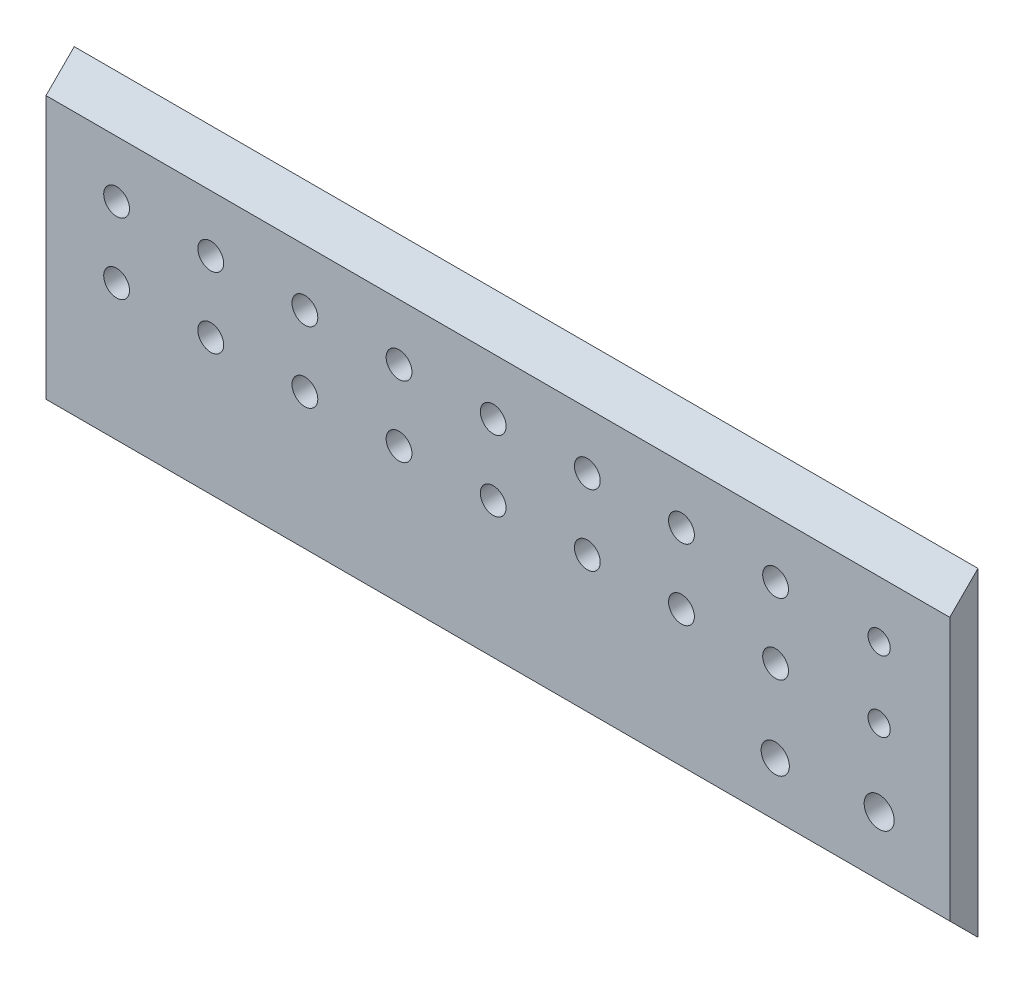
ISO-10303-21;
HEADER;
FILE_DESCRIPTION(('STEP AP214'),'2;1');
FILE_NAME('part.step','',(''),(''),'','','');
FILE_SCHEMA(('AUTOMOTIVE_DESIGN { 1 0 10303 214 1 1 1 1 }'));
ENDSEC;
DATA;
#1=APPLICATION_CONTEXT('core data for automotive mechanical design processes');
#2=APPLICATION_PROTOCOL_DEFINITION('international standard','automotive_design',2000,#1);
#3=PRODUCT_CONTEXT('',#1,'mechanical');
#4=PRODUCT('Part','Part','',(#3));
#5=PRODUCT_RELATED_PRODUCT_CATEGORY('part','',(#4));
#6=PRODUCT_DEFINITION_FORMATION('','',#4);
#7=PRODUCT_DEFINITION_CONTEXT('part definition',#1,'design');
#8=PRODUCT_DEFINITION('design','',#6,#7);
#9=PRODUCT_DEFINITION_SHAPE('','',#8);
#10=(LENGTH_UNIT() NAMED_UNIT(*) SI_UNIT(.MILLI.,.METRE.));
#11=(NAMED_UNIT(*) PLANE_ANGLE_UNIT() SI_UNIT($,.RADIAN.));
#12=(NAMED_UNIT(*) SI_UNIT($,.STERADIAN.) SOLID_ANGLE_UNIT());
#13=UNCERTAINTY_MEASURE_WITH_UNIT(LENGTH_MEASURE(1.E-05),#10,'distance_accuracy_value','');
#14=(GEOMETRIC_REPRESENTATION_CONTEXT(3) GLOBAL_UNCERTAINTY_ASSIGNED_CONTEXT((#13)) GLOBAL_UNIT_ASSIGNED_CONTEXT((#10,
#11,#12)) REPRESENTATION_CONTEXT('',''));
#15=CARTESIAN_POINT('',(0.,0.,0.));
#16=DIRECTION('',(0.,0.,1.));
#17=DIRECTION('',(1.,0.,0.));
#18=AXIS2_PLACEMENT_3D('',#15,#16,#17);
#19=CARTESIAN_POINT('',(164.041666666667,52.7920489685532,0.));
#20=DIRECTION('',(0.,0.,1.));
#21=DIRECTION('',(1.,0.,0.));
#22=AXIS2_PLACEMENT_3D('',#19,#20,#21);
#23=CYLINDRICAL_SURFACE('',#22,2.9);
#24=CARTESIAN_POINT('',(164.041666666667,52.7920489685532,0.));
#25=DIRECTION('',(0.,0.,1.));
#26=DIRECTION('',(1.,0.,0.));
#27=AXIS2_PLACEMENT_3D('',#24,#25,#26);
#28=CIRCLE('',#27,2.9);
#29=CARTESIAN_POINT('',(166.941666666667,52.7920489685532,0.));
#30=VERTEX_POINT('',#29);
#31=EDGE_CURVE('E41',#30,#30,#28,.T.);
#32=ORIENTED_EDGE('',*,*,#31,.F.);
#33=EDGE_LOOP('',(#32));
#34=FACE_BOUND('',#33,.T.);
#35=CARTESIAN_POINT('',(164.041666666667,52.7920489685532,6.35));
#36=DIRECTION('',(0.,0.,1.));
#37=DIRECTION('',(1.,0.,0.));
#38=AXIS2_PLACEMENT_3D('',#35,#36,#37);
#39=CIRCLE('',#38,2.9);
#40=CARTESIAN_POINT('',(166.941666666667,52.7920489685532,6.35));
#41=VERTEX_POINT('',#40);
#42=EDGE_CURVE('E11',#41,#41,#39,.T.);
#43=ORIENTED_EDGE('',*,*,#42,.T.);
#44=EDGE_LOOP('',(#43));
#45=FACE_BOUND('',#44,.T.);
#46=ADVANCED_FACE('F34',(#34,#45),#23,.F.);
#47=CARTESIAN_POINT('',(142.875,52.7920489685532,0.));
#48=DIRECTION('',(0.,0.,1.));
#49=DIRECTION('',(1.,0.,0.));
#50=AXIS2_PLACEMENT_3D('',#47,#48,#49);
#51=CYLINDRICAL_SURFACE('',#50,2.9);
#52=CARTESIAN_POINT('',(142.875,52.7920489685532,0.));
#53=DIRECTION('',(0.,0.,1.));
#54=DIRECTION('',(1.,0.,0.));
#55=AXIS2_PLACEMENT_3D('',#52,#53,#54);
#56=CIRCLE('',#55,2.9);
#57=CARTESIAN_POINT('',(145.775,52.7920489685532,0.));
#58=VERTEX_POINT('',#57);
#59=EDGE_CURVE('E131',#58,#58,#56,.T.);
#60=ORIENTED_EDGE('',*,*,#59,.F.);
#61=EDGE_LOOP('',(#60));
#62=FACE_BOUND('',#61,.T.);
#63=CARTESIAN_POINT('',(142.875,52.7920489685532,6.35));
#64=DIRECTION('',(0.,0.,1.));
#65=DIRECTION('',(1.,0.,0.));
#66=AXIS2_PLACEMENT_3D('',#63,#64,#65);
#67=CIRCLE('',#66,2.9);
#68=CARTESIAN_POINT('',(145.775,52.7920489685532,6.35));
#69=VERTEX_POINT('',#68);
#70=EDGE_CURVE('E134',#69,#69,#67,.T.);
#71=ORIENTED_EDGE('',*,*,#70,.T.);
#72=EDGE_LOOP('',(#71));
#73=FACE_BOUND('',#72,.T.);
#74=ADVANCED_FACE('F143',(#62,#73),#51,.F.);
#75=CARTESIAN_POINT('',(121.708333333333,52.7920489685532,0.));
#76=DIRECTION('',(0.,0.,1.));
#77=DIRECTION('',(1.,0.,0.));
#78=AXIS2_PLACEMENT_3D('',#75,#76,#77);
#79=CYLINDRICAL_SURFACE('',#78,2.9);
#80=CARTESIAN_POINT('',(121.708333333333,52.7920489685532,0.));
#81=DIRECTION('',(0.,0.,1.));
#82=DIRECTION('',(1.,0.,0.));
#83=AXIS2_PLACEMENT_3D('',#80,#81,#82);
#84=CIRCLE('',#83,2.9);
#85=CARTESIAN_POINT('',(124.608333333333,52.7920489685532,0.));
#86=VERTEX_POINT('',#85);
#87=EDGE_CURVE('E125',#86,#86,#84,.T.);
#88=ORIENTED_EDGE('',*,*,#87,.F.);
#89=EDGE_LOOP('',(#88));
#90=FACE_BOUND('',#89,.T.);
#91=CARTESIAN_POINT('',(121.708333333333,52.7920489685532,6.35));
#92=DIRECTION('',(0.,0.,1.));
#93=DIRECTION('',(1.,0.,0.));
#94=AXIS2_PLACEMENT_3D('',#91,#92,#93);
#95=CIRCLE('',#94,2.9);
#96=CARTESIAN_POINT('',(124.608333333333,52.7920489685532,6.35));
#97=VERTEX_POINT('',#96);
#98=EDGE_CURVE('E128',#97,#97,#95,.T.);
#99=ORIENTED_EDGE('',*,*,#98,.T.);
#100=EDGE_LOOP('',(#99));
#101=FACE_BOUND('',#100,.T.);
#102=ADVANCED_FACE('F178',(#90,#101),#79,.F.);
#103=CARTESIAN_POINT('',(100.541666666667,52.7920489685532,0.));
#104=DIRECTION('',(0.,0.,1.));
#105=DIRECTION('',(1.,0.,0.));
#106=AXIS2_PLACEMENT_3D('',#103,#104,#105);
#107=CYLINDRICAL_SURFACE('',#106,2.9);
#108=CARTESIAN_POINT('',(100.541666666667,52.7920489685532,0.));
#109=DIRECTION('',(0.,0.,1.));
#110=DIRECTION('',(1.,0.,0.));
#111=AXIS2_PLACEMENT_3D('',#108,#109,#110);
#112=CIRCLE('',#111,2.9);
#113=CARTESIAN_POINT('',(103.441666666667,52.7920489685532,0.));
#114=VERTEX_POINT('',#113);
#115=EDGE_CURVE('E119',#114,#114,#112,.T.);
#116=ORIENTED_EDGE('',*,*,#115,.F.);
#117=EDGE_LOOP('',(#116));
#118=FACE_BOUND('',#117,.T.);
#119=CARTESIAN_POINT('',(100.541666666667,52.7920489685532,6.35));
#120=DIRECTION('',(0.,0.,1.));
#121=DIRECTION('',(1.,0.,0.));
#122=AXIS2_PLACEMENT_3D('',#119,#120,#121);
#123=CIRCLE('',#122,2.9);
#124=CARTESIAN_POINT('',(103.441666666667,52.7920489685532,6.35));
#125=VERTEX_POINT('',#124);
#126=EDGE_CURVE('E122',#125,#125,#123,.T.);
#127=ORIENTED_EDGE('',*,*,#126,.T.);
#128=EDGE_LOOP('',(#127));
#129=FACE_BOUND('',#128,.T.);
#130=ADVANCED_FACE('F174',(#118,#129),#107,.F.);
#131=CARTESIAN_POINT('',(79.375,52.7920489685532,0.));
#132=DIRECTION('',(0.,0.,1.));
#133=DIRECTION('',(1.,0.,0.));
#134=AXIS2_PLACEMENT_3D('',#131,#132,#133);
#135=CYLINDRICAL_SURFACE('',#134,2.9);
#136=CARTESIAN_POINT('',(79.375,52.7920489685532,0.));
#137=DIRECTION('',(0.,0.,1.));
#138=DIRECTION('',(1.,0.,0.));
#139=AXIS2_PLACEMENT_3D('',#136,#137,#138);
#140=CIRCLE('',#139,2.9);
#141=CARTESIAN_POINT('',(82.275,52.7920489685532,0.));
#142=VERTEX_POINT('',#141);
#143=EDGE_CURVE('E113',#142,#142,#140,.T.);
#144=ORIENTED_EDGE('',*,*,#143,.F.);
#145=EDGE_LOOP('',(#144));
#146=FACE_BOUND('',#145,.T.);
#147=CARTESIAN_POINT('',(79.375,52.7920489685532,6.35));
#148=DIRECTION('',(0.,0.,1.));
#149=DIRECTION('',(1.,0.,0.));
#150=AXIS2_PLACEMENT_3D('',#147,#148,#149);
#151=CIRCLE('',#150,2.9);
#152=CARTESIAN_POINT('',(82.275,52.7920489685532,6.35));
#153=VERTEX_POINT('',#152);
#154=EDGE_CURVE('E116',#153,#153,#151,.T.);
#155=ORIENTED_EDGE('',*,*,#154,.T.);
#156=EDGE_LOOP('',(#155));
#157=FACE_BOUND('',#156,.T.);
#158=ADVANCED_FACE('F170',(#146,#157),#135,.F.);
#159=CARTESIAN_POINT('',(58.2083333333333,52.7920489685532,0.));
#160=DIRECTION('',(0.,0.,1.));
#161=DIRECTION('',(1.,0.,0.));
#162=AXIS2_PLACEMENT_3D('',#159,#160,#161);
#163=CYLINDRICAL_SURFACE('',#162,2.9);
#164=CARTESIAN_POINT('',(58.2083333333333,52.7920489685532,0.));
#165=DIRECTION('',(0.,0.,1.));
#166=DIRECTION('',(1.,0.,0.));
#167=AXIS2_PLACEMENT_3D('',#164,#165,#166);
#168=CIRCLE('',#167,2.9);
#169=CARTESIAN_POINT('',(61.1083333333333,52.7920489685532,0.));
#170=VERTEX_POINT('',#169);
#171=EDGE_CURVE('E94',#170,#170,#168,.T.);
#172=ORIENTED_EDGE('',*,*,#171,.F.);
#173=EDGE_LOOP('',(#172));
#174=FACE_BOUND('',#173,.T.);
#175=CARTESIAN_POINT('',(58.2083333333333,52.7920489685532,6.35));
#176=DIRECTION('',(0.,0.,1.));
#177=DIRECTION('',(1.,0.,0.));
#178=AXIS2_PLACEMENT_3D('',#175,#176,#177);
#179=CIRCLE('',#178,2.9);
#180=CARTESIAN_POINT('',(61.1083333333333,52.7920489685532,6.35));
#181=VERTEX_POINT('',#180);
#182=EDGE_CURVE('E98',#181,#181,#179,.T.);
#183=ORIENTED_EDGE('',*,*,#182,.T.);
#184=EDGE_LOOP('',(#183));
#185=FACE_BOUND('',#184,.T.);
#186=ADVANCED_FACE('F166',(#174,#185),#163,.F.);
#187=CARTESIAN_POINT('',(0.,0.,6.35));
#188=DIRECTION('',(1.,0.,0.));
#189=DIRECTION('',(0.,0.,-1.));
#190=AXIS2_PLACEMENT_3D('',#187,#188,#189);
#191=PLANE('',#190);
#192=DIRECTION('',(0.,-1.,0.));
#193=VECTOR('',#192,1.);
#194=CARTESIAN_POINT('',(0.,0.,6.35));
#195=LINE('',#194,#193);
#196=CARTESIAN_POINT('',(0.,65.4920489685532,6.35));
#197=VERTEX_POINT('',#196);
#198=CARTESIAN_POINT('',(0.,6.35,6.35));
#199=VERTEX_POINT('',#198);
#200=EDGE_CURVE('E95',#197,#199,#195,.T.);
#201=ORIENTED_EDGE('',*,*,#200,.F.);
#202=DIRECTION('',(0.,-0.707106781186547,0.707106781186548));
#203=VECTOR('',#202,1.);
#204=CARTESIAN_POINT('',(0.,65.4920489685532,6.35));
#205=LINE('',#204,#203);
#206=CARTESIAN_POINT('',(0.,71.8420489685532,0.));
#207=VERTEX_POINT('',#206);
#208=EDGE_CURVE('E76',#207,#197,#205,.T.);
#209=ORIENTED_EDGE('',*,*,#208,.F.);
#210=DIRECTION('',(0.,-1.,0.));
#211=VECTOR('',#210,1.);
#212=CARTESIAN_POINT('',(0.,0.,0.));
#213=LINE('',#212,#211);
#214=CARTESIAN_POINT('',(0.,0.,0.));
#215=VERTEX_POINT('',#214);
#216=EDGE_CURVE('E104',#207,#215,#213,.T.);
#217=ORIENTED_EDGE('',*,*,#216,.T.);
#218=DIRECTION('',(0.,-0.707106781186548,-0.707106781186547));
#219=VECTOR('',#218,1.);
#220=CARTESIAN_POINT('',(0.,6.35,6.35));
#221=LINE('',#220,#219);
#222=EDGE_CURVE('E56',#199,#215,#221,.T.);
#223=ORIENTED_EDGE('',*,*,#222,.F.);
#224=EDGE_LOOP('',(#201,#209,#217,#223));
#225=FACE_BOUND('',#224,.T.);
#226=ADVANCED_FACE('F157',(#225),#191,.F.);
#227=CARTESIAN_POINT('',(203.2,0.,6.35));
#228=DIRECTION('',(-1.,0.,0.));
#229=DIRECTION('',(0.,0.,1.));
#230=AXIS2_PLACEMENT_3D('',#227,#228,#229);
#231=PLANE('',#230);
#232=DIRECTION('',(0.,1.,0.));
#233=VECTOR('',#232,1.);
#234=CARTESIAN_POINT('',(203.2,0.,0.));
#235=LINE('',#234,#233);
#236=CARTESIAN_POINT('',(203.2,0.,0.));
#237=VERTEX_POINT('',#236);
#238=CARTESIAN_POINT('',(203.2,71.8420489685532,0.));
#239=VERTEX_POINT('',#238);
#240=EDGE_CURVE('E87',#237,#239,#235,.T.);
#241=ORIENTED_EDGE('',*,*,#240,.T.);
#242=DIRECTION('',(0.,-0.707106781186547,0.707106781186548));
#243=VECTOR('',#242,1.);
#244=CARTESIAN_POINT('',(203.2,65.4920489685532,6.35));
#245=LINE('',#244,#243);
#246=CARTESIAN_POINT('',(203.2,65.4920489685532,6.35));
#247=VERTEX_POINT('',#246);
#248=EDGE_CURVE('E48',#239,#247,#245,.T.);
#249=ORIENTED_EDGE('',*,*,#248,.T.);
#250=DIRECTION('',(0.,1.,0.));
#251=VECTOR('',#250,1.);
#252=CARTESIAN_POINT('',(203.2,0.,6.35));
#253=LINE('',#252,#251);
#254=CARTESIAN_POINT('',(203.2,6.35,6.35));
#255=VERTEX_POINT('',#254);
#256=EDGE_CURVE('E85',#255,#247,#253,.T.);
#257=ORIENTED_EDGE('',*,*,#256,.F.);
#258=DIRECTION('',(0.,-0.707106781186548,-0.707106781186547));
#259=VECTOR('',#258,1.);
#260=CARTESIAN_POINT('',(203.2,6.35,6.35));
#261=LINE('',#260,#259);
#262=EDGE_CURVE('E484',#255,#237,#261,.T.);
#263=ORIENTED_EDGE('',*,*,#262,.T.);
#264=EDGE_LOOP('',(#241,#249,#257,#263));
#265=FACE_BOUND('',#264,.T.);
#266=ADVANCED_FACE('F83',(#265),#231,.F.);
#267=CARTESIAN_POINT('',(0.,0.,6.35));
#268=DIRECTION('',(0.,0.,-1.));
#269=DIRECTION('',(-1.,0.,0.));
#270=AXIS2_PLACEMENT_3D('',#267,#268,#269);
#271=PLANE('',#270);
#272=CARTESIAN_POINT('',(163.957,18.4642256934485,6.35));
#273=DIRECTION('',(0.,0.,1.));
#274=DIRECTION('',(1.,0.,0.));
#275=AXIS2_PLACEMENT_3D('',#272,#273,#274);
#276=CIRCLE('',#275,3.175);
#277=CARTESIAN_POINT('',(167.132,18.4642256934485,6.35));
#278=VERTEX_POINT('',#277);
#279=EDGE_CURVE('E401',#278,#278,#276,.T.);
#280=ORIENTED_EDGE('',*,*,#279,.F.);
#281=EDGE_LOOP('',(#280));
#282=FACE_BOUND('',#281,.T.);
#283=CARTESIAN_POINT('',(187.325,19.6511137980185,6.35));
#284=DIRECTION('',(0.,0.,1.));
#285=DIRECTION('',(1.,0.,0.));
#286=AXIS2_PLACEMENT_3D('',#283,#284,#285);
#287=CIRCLE('',#286,3.37499999999999);
#288=CARTESIAN_POINT('',(190.7,19.6511137980185,6.35));
#289=VERTEX_POINT('',#288);
#290=EDGE_CURVE('E403',#289,#289,#287,.T.);
#291=ORIENTED_EDGE('',*,*,#290,.F.);
#292=EDGE_LOOP('',(#291));
#293=FACE_BOUND('',#292,.T.);
#294=CARTESIAN_POINT('',(187.325,36.9170489685532,6.35));
#295=DIRECTION('',(0.,0.,1.));
#296=DIRECTION('',(1.,0.,0.));
#297=AXIS2_PLACEMENT_3D('',#294,#295,#296);
#298=CIRCLE('',#297,2.5);
#299=CARTESIAN_POINT('',(189.825,36.9170489685532,6.35));
#300=VERTEX_POINT('',#299);
#301=EDGE_CURVE('E409',#300,#300,#298,.T.);
#302=ORIENTED_EDGE('',*,*,#301,.F.);
#303=EDGE_LOOP('',(#302));
#304=FACE_BOUND('',#303,.T.);
#305=CARTESIAN_POINT('',(187.325,52.7920489685532,6.35));
#306=DIRECTION('',(0.,0.,1.));
#307=DIRECTION('',(1.,0.,0.));
#308=AXIS2_PLACEMENT_3D('',#305,#306,#307);
#309=CIRCLE('',#308,2.5);
#310=CARTESIAN_POINT('',(189.825,52.7920489685532,6.35));
#311=VERTEX_POINT('',#310);
#312=EDGE_CURVE('E415',#311,#311,#309,.T.);
#313=ORIENTED_EDGE('',*,*,#312,.F.);
#314=EDGE_LOOP('',(#313));
#315=FACE_BOUND('',#314,.T.);
#316=CARTESIAN_POINT('',(37.0416666666667,36.9170489685532,6.35));
#317=DIRECTION('',(0.,0.,1.));
#318=DIRECTION('',(1.,0.,0.));
#319=AXIS2_PLACEMENT_3D('',#316,#317,#318);
#320=CIRCLE('',#319,2.9);
#321=CARTESIAN_POINT('',(39.9416666666667,36.9170489685532,6.35));
#322=VERTEX_POINT('',#321);
#323=EDGE_CURVE('E428',#322,#322,#320,.T.);
#324=ORIENTED_EDGE('',*,*,#323,.F.);
#325=EDGE_LOOP('',(#324));
#326=FACE_BOUND('',#325,.T.);
#327=CARTESIAN_POINT('',(58.2083333333333,36.9170489685532,6.35));
#328=DIRECTION('',(0.,0.,1.));
#329=DIRECTION('',(1.,0.,0.));
#330=AXIS2_PLACEMENT_3D('',#327,#328,#329);
#331=CIRCLE('',#330,2.9);
#332=CARTESIAN_POINT('',(61.1083333333333,36.9170489685532,6.35));
#333=VERTEX_POINT('',#332);
#334=EDGE_CURVE('E434',#333,#333,#331,.T.);
#335=ORIENTED_EDGE('',*,*,#334,.F.);
#336=EDGE_LOOP('',(#335));
#337=FACE_BOUND('',#336,.T.);
#338=CARTESIAN_POINT('',(79.375,36.9170489685532,6.35));
#339=DIRECTION('',(0.,0.,1.));
#340=DIRECTION('',(1.,0.,0.));
#341=AXIS2_PLACEMENT_3D('',#338,#339,#340);
#342=CIRCLE('',#341,2.9);
#343=CARTESIAN_POINT('',(82.275,36.9170489685532,6.35));
#344=VERTEX_POINT('',#343);
#345=EDGE_CURVE('E440',#344,#344,#342,.T.);
#346=ORIENTED_EDGE('',*,*,#345,.F.);
#347=EDGE_LOOP('',(#346));
#348=FACE_BOUND('',#347,.T.);
#349=CARTESIAN_POINT('',(100.541666666667,36.9170489685532,6.35));
#350=DIRECTION('',(0.,0.,1.));
#351=DIRECTION('',(1.,0.,0.));
#352=AXIS2_PLACEMENT_3D('',#349,#350,#351);
#353=CIRCLE('',#352,2.9);
#354=CARTESIAN_POINT('',(103.441666666667,36.9170489685532,6.35));
#355=VERTEX_POINT('',#354);
#356=EDGE_CURVE('E446',#355,#355,#353,.T.);
#357=ORIENTED_EDGE('',*,*,#356,.F.);
#358=EDGE_LOOP('',(#357));
#359=FACE_BOUND('',#358,.T.);
#360=CARTESIAN_POINT('',(121.708333333333,36.9170489685532,6.35));
#361=DIRECTION('',(0.,0.,1.));
#362=DIRECTION('',(1.,0.,0.));
#363=AXIS2_PLACEMENT_3D('',#360,#361,#362);
#364=CIRCLE('',#363,2.9);
#365=CARTESIAN_POINT('',(124.608333333333,36.9170489685532,6.35));
#366=VERTEX_POINT('',#365);
#367=EDGE_CURVE('E452',#366,#366,#364,.T.);
#368=ORIENTED_EDGE('',*,*,#367,.F.);
#369=EDGE_LOOP('',(#368));
#370=FACE_BOUND('',#369,.T.);
#371=CARTESIAN_POINT('',(142.875,36.9170489685532,6.35));
#372=DIRECTION('',(0.,0.,1.));
#373=DIRECTION('',(1.,0.,0.));
#374=AXIS2_PLACEMENT_3D('',#371,#372,#373);
#375=CIRCLE('',#374,2.9);
#376=CARTESIAN_POINT('',(145.775,36.9170489685532,6.35));
#377=VERTEX_POINT('',#376);
#378=EDGE_CURVE('E458',#377,#377,#375,.T.);
#379=ORIENTED_EDGE('',*,*,#378,.F.);
#380=EDGE_LOOP('',(#379));
#381=FACE_BOUND('',#380,.T.);
#382=CARTESIAN_POINT('',(164.041666666667,36.9170489685532,6.35));
#383=DIRECTION('',(0.,0.,1.));
#384=DIRECTION('',(1.,0.,0.));
#385=AXIS2_PLACEMENT_3D('',#382,#383,#384);
#386=CIRCLE('',#385,2.9);
#387=CARTESIAN_POINT('',(166.941666666667,36.9170489685532,6.35));
#388=VERTEX_POINT('',#387);
#389=EDGE_CURVE('E421',#388,#388,#386,.T.);
#390=ORIENTED_EDGE('',*,*,#389,.F.);
#391=EDGE_LOOP('',(#390));
#392=FACE_BOUND('',#391,.T.);
#393=CARTESIAN_POINT('',(15.875,36.9170489685532,6.35));
#394=DIRECTION('',(0.,0.,1.));
#395=DIRECTION('',(1.,0.,0.));
#396=AXIS2_PLACEMENT_3D('',#393,#394,#395);
#397=CIRCLE('',#396,2.9);
#398=CARTESIAN_POINT('',(18.775,36.9170489685532,6.35));
#399=VERTEX_POINT('',#398);
#400=EDGE_CURVE('E427',#399,#399,#397,.T.);
#401=ORIENTED_EDGE('',*,*,#400,.F.);
#402=EDGE_LOOP('',(#401));
#403=FACE_BOUND('',#402,.T.);
#404=CARTESIAN_POINT('',(37.0416666666667,52.7920489685532,6.35));
#405=DIRECTION('',(0.,0.,1.));
#406=DIRECTION('',(1.,0.,0.));
#407=AXIS2_PLACEMENT_3D('',#404,#405,#406);
#408=CIRCLE('',#407,2.9);
#409=CARTESIAN_POINT('',(39.9416666666667,52.7920489685532,6.35));
#410=VERTEX_POINT('',#409);
#411=EDGE_CURVE('E474',#410,#410,#408,.T.);
#412=ORIENTED_EDGE('',*,*,#411,.F.);
#413=EDGE_LOOP('',(#412));
#414=FACE_BOUND('',#413,.T.);
#415=CARTESIAN_POINT('',(15.875,52.7920489685532,6.35));
#416=DIRECTION('',(0.,0.,1.));
#417=DIRECTION('',(1.,0.,0.));
#418=AXIS2_PLACEMENT_3D('',#415,#416,#417);
#419=CIRCLE('',#418,2.9);
#420=CARTESIAN_POINT('',(18.775,52.7920489685532,6.35));
#421=VERTEX_POINT('',#420);
#422=EDGE_CURVE('E477',#421,#421,#419,.T.);
#423=ORIENTED_EDGE('',*,*,#422,.F.);
#424=EDGE_LOOP('',(#423));
#425=FACE_BOUND('',#424,.T.);
#426=ORIENTED_EDGE('',*,*,#256,.T.);
#427=DIRECTION('',(-1.,0.,0.));
#428=VECTOR('',#427,1.);
#429=CARTESIAN_POINT('',(203.2,65.4920489685532,6.35));
#430=LINE('',#429,#428);
#431=EDGE_CURVE('E73',#247,#197,#430,.T.);
#432=ORIENTED_EDGE('',*,*,#431,.T.);
#433=ORIENTED_EDGE('',*,*,#200,.T.);
#434=DIRECTION('',(-1.,0.,0.));
#435=VECTOR('',#434,1.);
#436=CARTESIAN_POINT('',(203.2,6.35,6.35));
#437=LINE('',#436,#435);
#438=EDGE_CURVE('E93',#255,#199,#437,.T.);
#439=ORIENTED_EDGE('',*,*,#438,.F.);
#440=EDGE_LOOP('',(#426,#432,#433,#439));
#441=FACE_BOUND('',#440,.T.);
#442=ORIENTED_EDGE('',*,*,#182,.F.);
#443=EDGE_LOOP('',(#442));
#444=FACE_BOUND('',#443,.T.);
#445=ORIENTED_EDGE('',*,*,#154,.F.);
#446=EDGE_LOOP('',(#445));
#447=FACE_BOUND('',#446,.T.);
#448=ORIENTED_EDGE('',*,*,#126,.F.);
#449=EDGE_LOOP('',(#448));
#450=FACE_BOUND('',#449,.T.);
#451=ORIENTED_EDGE('',*,*,#98,.F.);
#452=EDGE_LOOP('',(#451));
#453=FACE_BOUND('',#452,.T.);
#454=ORIENTED_EDGE('',*,*,#70,.F.);
#455=EDGE_LOOP('',(#454));
#456=FACE_BOUND('',#455,.T.);
#457=ORIENTED_EDGE('',*,*,#42,.F.);
#458=EDGE_LOOP('',(#457));
#459=FACE_BOUND('',#458,.T.);
#460=ADVANCED_FACE('F91',(#282,#293,#304,#315,#326,#337,#348,#359,#370,#381,#392,#403,#414,#425,
#441,#444,#447,#450,#453,#456,#459),#271,.F.);
#461=CARTESIAN_POINT('',(0.,0.,0.));
#462=DIRECTION('',(0.,0.,-1.));
#463=DIRECTION('',(-1.,0.,0.));
#464=AXIS2_PLACEMENT_3D('',#461,#462,#463);
#465=PLANE('',#464);
#466=CARTESIAN_POINT('',(163.957,18.4642256934485,0.));
#467=DIRECTION('',(0.,0.,1.));
#468=DIRECTION('',(1.,0.,0.));
#469=AXIS2_PLACEMENT_3D('',#466,#467,#468);
#470=CIRCLE('',#469,3.175);
#471=CARTESIAN_POINT('',(167.132,18.4642256934485,0.));
#472=VERTEX_POINT('',#471);
#473=EDGE_CURVE('E399',#472,#472,#470,.T.);
#474=ORIENTED_EDGE('',*,*,#473,.T.);
#475=EDGE_LOOP('',(#474));
#476=FACE_BOUND('',#475,.T.);
#477=CARTESIAN_POINT('',(187.325,19.6511137980185,0.));
#478=DIRECTION('',(0.,0.,1.));
#479=DIRECTION('',(1.,0.,0.));
#480=AXIS2_PLACEMENT_3D('',#477,#478,#479);
#481=CIRCLE('',#480,3.37499999999999);
#482=CARTESIAN_POINT('',(190.7,19.6511137980185,0.));
#483=VERTEX_POINT('',#482);
#484=EDGE_CURVE('E406',#483,#483,#481,.T.);
#485=ORIENTED_EDGE('',*,*,#484,.T.);
#486=EDGE_LOOP('',(#485));
#487=FACE_BOUND('',#486,.T.);
#488=CARTESIAN_POINT('',(187.325,36.9170489685532,0.));
#489=DIRECTION('',(0.,0.,1.));
#490=DIRECTION('',(1.,0.,0.));
#491=AXIS2_PLACEMENT_3D('',#488,#489,#490);
#492=CIRCLE('',#491,2.5);
#493=CARTESIAN_POINT('',(189.825,36.9170489685532,0.));
#494=VERTEX_POINT('',#493);
#495=EDGE_CURVE('E412',#494,#494,#492,.T.);
#496=ORIENTED_EDGE('',*,*,#495,.T.);
#497=EDGE_LOOP('',(#496));
#498=FACE_BOUND('',#497,.T.);
#499=CARTESIAN_POINT('',(187.325,52.7920489685532,0.));
#500=DIRECTION('',(0.,0.,1.));
#501=DIRECTION('',(1.,0.,0.));
#502=AXIS2_PLACEMENT_3D('',#499,#500,#501);
#503=CIRCLE('',#502,2.5);
#504=CARTESIAN_POINT('',(189.825,52.7920489685532,0.));
#505=VERTEX_POINT('',#504);
#506=EDGE_CURVE('E418',#505,#505,#503,.T.);
#507=ORIENTED_EDGE('',*,*,#506,.T.);
#508=EDGE_LOOP('',(#507));
#509=FACE_BOUND('',#508,.T.);
#510=CARTESIAN_POINT('',(37.0416666666667,36.9170489685532,0.));
#511=DIRECTION('',(0.,0.,1.));
#512=DIRECTION('',(1.,0.,0.));
#513=AXIS2_PLACEMENT_3D('',#510,#511,#512);
#514=CIRCLE('',#513,2.9);
#515=CARTESIAN_POINT('',(39.9416666666667,36.9170489685532,0.));
#516=VERTEX_POINT('',#515);
#517=EDGE_CURVE('E424',#516,#516,#514,.T.);
#518=ORIENTED_EDGE('',*,*,#517,.T.);
#519=EDGE_LOOP('',(#518));
#520=FACE_BOUND('',#519,.T.);
#521=CARTESIAN_POINT('',(58.2083333333333,36.9170489685532,0.));
#522=DIRECTION('',(0.,0.,1.));
#523=DIRECTION('',(1.,0.,0.));
#524=AXIS2_PLACEMENT_3D('',#521,#522,#523);
#525=CIRCLE('',#524,2.9);
#526=CARTESIAN_POINT('',(61.1083333333333,36.9170489685532,0.));
#527=VERTEX_POINT('',#526);
#528=EDGE_CURVE('E431',#527,#527,#525,.T.);
#529=ORIENTED_EDGE('',*,*,#528,.T.);
#530=EDGE_LOOP('',(#529));
#531=FACE_BOUND('',#530,.T.);
#532=CARTESIAN_POINT('',(79.375,36.9170489685532,0.));
#533=DIRECTION('',(0.,0.,1.));
#534=DIRECTION('',(1.,0.,0.));
#535=AXIS2_PLACEMENT_3D('',#532,#533,#534);
#536=CIRCLE('',#535,2.9);
#537=CARTESIAN_POINT('',(82.275,36.9170489685532,0.));
#538=VERTEX_POINT('',#537);
#539=EDGE_CURVE('E437',#538,#538,#536,.T.);
#540=ORIENTED_EDGE('',*,*,#539,.T.);
#541=EDGE_LOOP('',(#540));
#542=FACE_BOUND('',#541,.T.);
#543=CARTESIAN_POINT('',(100.541666666667,36.9170489685532,0.));
#544=DIRECTION('',(0.,0.,1.));
#545=DIRECTION('',(1.,0.,0.));
#546=AXIS2_PLACEMENT_3D('',#543,#544,#545);
#547=CIRCLE('',#546,2.9);
#548=CARTESIAN_POINT('',(103.441666666667,36.9170489685532,0.));
#549=VERTEX_POINT('',#548);
#550=EDGE_CURVE('E443',#549,#549,#547,.T.);
#551=ORIENTED_EDGE('',*,*,#550,.T.);
#552=EDGE_LOOP('',(#551));
#553=FACE_BOUND('',#552,.T.);
#554=CARTESIAN_POINT('',(121.708333333333,36.9170489685532,0.));
#555=DIRECTION('',(0.,0.,1.));
#556=DIRECTION('',(1.,0.,0.));
#557=AXIS2_PLACEMENT_3D('',#554,#555,#556);
#558=CIRCLE('',#557,2.9);
#559=CARTESIAN_POINT('',(124.608333333333,36.9170489685532,0.));
#560=VERTEX_POINT('',#559);
#561=EDGE_CURVE('E449',#560,#560,#558,.T.);
#562=ORIENTED_EDGE('',*,*,#561,.T.);
#563=EDGE_LOOP('',(#562));
#564=FACE_BOUND('',#563,.T.);
#565=CARTESIAN_POINT('',(142.875,36.9170489685532,0.));
#566=DIRECTION('',(0.,0.,1.));
#567=DIRECTION('',(1.,0.,0.));
#568=AXIS2_PLACEMENT_3D('',#565,#566,#567);
#569=CIRCLE('',#568,2.9);
#570=CARTESIAN_POINT('',(145.775,36.9170489685532,0.));
#571=VERTEX_POINT('',#570);
#572=EDGE_CURVE('E455',#571,#571,#569,.T.);
#573=ORIENTED_EDGE('',*,*,#572,.T.);
#574=EDGE_LOOP('',(#573));
#575=FACE_BOUND('',#574,.T.);
#576=CARTESIAN_POINT('',(164.041666666667,36.9170489685532,0.));
#577=DIRECTION('',(0.,0.,1.));
#578=DIRECTION('',(1.,0.,0.));
#579=AXIS2_PLACEMENT_3D('',#576,#577,#578);
#580=CIRCLE('',#579,2.9);
#581=CARTESIAN_POINT('',(166.941666666667,36.9170489685532,0.));
#582=VERTEX_POINT('',#581);
#583=EDGE_CURVE('E461',#582,#582,#580,.T.);
#584=ORIENTED_EDGE('',*,*,#583,.T.);
#585=EDGE_LOOP('',(#584));
#586=FACE_BOUND('',#585,.T.);
#587=CARTESIAN_POINT('',(15.875,36.9170489685532,0.));
#588=DIRECTION('',(0.,0.,1.));
#589=DIRECTION('',(1.,0.,0.));
#590=AXIS2_PLACEMENT_3D('',#587,#588,#589);
#591=CIRCLE('',#590,2.9);
#592=CARTESIAN_POINT('',(18.775,36.9170489685532,0.));
#593=VERTEX_POINT('',#592);
#594=EDGE_CURVE('E466',#593,#593,#591,.T.);
#595=ORIENTED_EDGE('',*,*,#594,.T.);
#596=EDGE_LOOP('',(#595));
#597=FACE_BOUND('',#596,.T.);
#598=CARTESIAN_POINT('',(37.0416666666667,52.7920489685532,0.));
#599=DIRECTION('',(0.,0.,1.));
#600=DIRECTION('',(1.,0.,0.));
#601=AXIS2_PLACEMENT_3D('',#598,#599,#600);
#602=CIRCLE('',#601,2.9);
#603=CARTESIAN_POINT('',(39.9416666666667,52.7920489685532,0.));
#604=VERTEX_POINT('',#603);
#605=EDGE_CURVE('E469',#604,#604,#602,.T.);
#606=ORIENTED_EDGE('',*,*,#605,.T.);
#607=EDGE_LOOP('',(#606));
#608=FACE_BOUND('',#607,.T.);
#609=CARTESIAN_POINT('',(15.875,52.7920489685532,0.));
#610=DIRECTION('',(0.,0.,1.));
#611=DIRECTION('',(1.,0.,0.));
#612=AXIS2_PLACEMENT_3D('',#609,#610,#611);
#613=CIRCLE('',#612,2.9);
#614=CARTESIAN_POINT('',(18.775,52.7920489685532,0.));
#615=VERTEX_POINT('',#614);
#616=EDGE_CURVE('E478',#615,#615,#613,.T.);
#617=ORIENTED_EDGE('',*,*,#616,.T.);
#618=EDGE_LOOP('',(#617));
#619=FACE_BOUND('',#618,.T.);
#620=ORIENTED_EDGE('',*,*,#216,.F.);
#621=DIRECTION('',(-1.,0.,0.));
#622=VECTOR('',#621,1.);
#623=CARTESIAN_POINT('',(0.,71.8420489685532,0.));
#624=LINE('',#623,#622);
#625=EDGE_CURVE('E100',#239,#207,#624,.T.);
#626=ORIENTED_EDGE('',*,*,#625,.F.);
#627=ORIENTED_EDGE('',*,*,#240,.F.);
#628=DIRECTION('',(1.,0.,0.));
#629=VECTOR('',#628,1.);
#630=CARTESIAN_POINT('',(0.,0.,0.));
#631=LINE('',#630,#629);
#632=EDGE_CURVE('E107',#215,#237,#631,.T.);
#633=ORIENTED_EDGE('',*,*,#632,.F.);
#634=EDGE_LOOP('',(#620,#626,#627,#633));
#635=FACE_BOUND('',#634,.T.);
#636=ORIENTED_EDGE('',*,*,#171,.T.);
#637=EDGE_LOOP('',(#636));
#638=FACE_BOUND('',#637,.T.);
#639=ORIENTED_EDGE('',*,*,#143,.T.);
#640=EDGE_LOOP('',(#639));
#641=FACE_BOUND('',#640,.T.);
#642=ORIENTED_EDGE('',*,*,#115,.T.);
#643=EDGE_LOOP('',(#642));
#644=FACE_BOUND('',#643,.T.);
#645=ORIENTED_EDGE('',*,*,#87,.T.);
#646=EDGE_LOOP('',(#645));
#647=FACE_BOUND('',#646,.T.);
#648=ORIENTED_EDGE('',*,*,#59,.T.);
#649=EDGE_LOOP('',(#648));
#650=FACE_BOUND('',#649,.T.);
#651=ORIENTED_EDGE('',*,*,#31,.T.);
#652=EDGE_LOOP('',(#651));
#653=FACE_BOUND('',#652,.T.);
#654=ADVANCED_FACE('F139',(#476,#487,#498,#509,#520,#531,#542,#553,#564,#575,#586,#597,#608,
#619,#635,#638,#641,#644,#647,#650,#653),#465,.T.);
#655=CARTESIAN_POINT('',(203.2,6.35,6.35));
#656=DIRECTION('',(0.,0.707106781186547,-0.707106781186548));
#657=DIRECTION('',(0.,0.707106781186548,0.707106781186547));
#658=AXIS2_PLACEMENT_3D('',#655,#656,#657);
#659=PLANE('',#658);
#660=ORIENTED_EDGE('',*,*,#222,.T.);
#661=ORIENTED_EDGE('',*,*,#632,.T.);
#662=ORIENTED_EDGE('',*,*,#262,.F.);
#663=ORIENTED_EDGE('',*,*,#438,.T.);
#664=EDGE_LOOP('',(#660,#661,#662,#663));
#665=FACE_BOUND('',#664,.T.);
#666=ADVANCED_FACE('F153',(#665),#659,.F.);
#667=CARTESIAN_POINT('',(203.2,65.4920489685532,6.35));
#668=DIRECTION('',(0.,-0.707106781186548,-0.707106781186547));
#669=DIRECTION('',(0.,0.707106781186547,-0.707106781186548));
#670=AXIS2_PLACEMENT_3D('',#667,#668,#669);
#671=PLANE('',#670);
#672=ORIENTED_EDGE('',*,*,#208,.T.);
#673=ORIENTED_EDGE('',*,*,#431,.F.);
#674=ORIENTED_EDGE('',*,*,#248,.F.);
#675=ORIENTED_EDGE('',*,*,#625,.T.);
#676=EDGE_LOOP('',(#672,#673,#674,#675));
#677=FACE_BOUND('',#676,.T.);
#678=ADVANCED_FACE('F74',(#677),#671,.F.);
#679=CARTESIAN_POINT('',(15.875,52.7920489685532,0.));
#680=DIRECTION('',(0.,0.,1.));
#681=DIRECTION('',(1.,0.,0.));
#682=AXIS2_PLACEMENT_3D('',#679,#680,#681);
#683=CYLINDRICAL_SURFACE('',#682,2.9);
#684=ORIENTED_EDGE('',*,*,#616,.F.);
#685=EDGE_LOOP('',(#684));
#686=FACE_BOUND('',#685,.T.);
#687=ORIENTED_EDGE('',*,*,#422,.T.);
#688=EDGE_LOOP('',(#687));
#689=FACE_BOUND('',#688,.T.);
#690=ADVANCED_FACE('F240',(#686,#689),#683,.F.);
#691=CARTESIAN_POINT('',(37.0416666666667,52.7920489685532,0.));
#692=DIRECTION('',(0.,0.,1.));
#693=DIRECTION('',(1.,0.,0.));
#694=AXIS2_PLACEMENT_3D('',#691,#692,#693);
#695=CYLINDRICAL_SURFACE('',#694,2.9);
#696=ORIENTED_EDGE('',*,*,#605,.F.);
#697=EDGE_LOOP('',(#696));
#698=FACE_BOUND('',#697,.T.);
#699=ORIENTED_EDGE('',*,*,#411,.T.);
#700=EDGE_LOOP('',(#699));
#701=FACE_BOUND('',#700,.T.);
#702=ADVANCED_FACE('F246',(#698,#701),#695,.F.);
#703=CARTESIAN_POINT('',(15.875,36.9170489685532,0.));
#704=DIRECTION('',(0.,0.,1.));
#705=DIRECTION('',(1.,0.,0.));
#706=AXIS2_PLACEMENT_3D('',#703,#704,#705);
#707=CYLINDRICAL_SURFACE('',#706,2.9);
#708=ORIENTED_EDGE('',*,*,#594,.F.);
#709=EDGE_LOOP('',(#708));
#710=FACE_BOUND('',#709,.T.);
#711=ORIENTED_EDGE('',*,*,#400,.T.);
#712=EDGE_LOOP('',(#711));
#713=FACE_BOUND('',#712,.T.);
#714=ADVANCED_FACE('F253',(#710,#713),#707,.F.);
#715=CARTESIAN_POINT('',(164.041666666667,36.9170489685532,0.));
#716=DIRECTION('',(0.,0.,1.));
#717=DIRECTION('',(1.,0.,0.));
#718=AXIS2_PLACEMENT_3D('',#715,#716,#717);
#719=CYLINDRICAL_SURFACE('',#718,2.9);
#720=ORIENTED_EDGE('',*,*,#583,.F.);
#721=EDGE_LOOP('',(#720));
#722=FACE_BOUND('',#721,.T.);
#723=ORIENTED_EDGE('',*,*,#389,.T.);
#724=EDGE_LOOP('',(#723));
#725=FACE_BOUND('',#724,.T.);
#726=ADVANCED_FACE('F261',(#722,#725),#719,.F.);
#727=CARTESIAN_POINT('',(142.875,36.9170489685532,0.));
#728=DIRECTION('',(0.,0.,1.));
#729=DIRECTION('',(1.,0.,0.));
#730=AXIS2_PLACEMENT_3D('',#727,#728,#729);
#731=CYLINDRICAL_SURFACE('',#730,2.9);
#732=ORIENTED_EDGE('',*,*,#572,.F.);
#733=EDGE_LOOP('',(#732));
#734=FACE_BOUND('',#733,.T.);
#735=ORIENTED_EDGE('',*,*,#378,.T.);
#736=EDGE_LOOP('',(#735));
#737=FACE_BOUND('',#736,.T.);
#738=ADVANCED_FACE('F269',(#734,#737),#731,.F.);
#739=CARTESIAN_POINT('',(121.708333333333,36.9170489685532,0.));
#740=DIRECTION('',(0.,0.,1.));
#741=DIRECTION('',(1.,0.,0.));
#742=AXIS2_PLACEMENT_3D('',#739,#740,#741);
#743=CYLINDRICAL_SURFACE('',#742,2.9);
#744=ORIENTED_EDGE('',*,*,#561,.F.);
#745=EDGE_LOOP('',(#744));
#746=FACE_BOUND('',#745,.T.);
#747=ORIENTED_EDGE('',*,*,#367,.T.);
#748=EDGE_LOOP('',(#747));
#749=FACE_BOUND('',#748,.T.);
#750=ADVANCED_FACE('F277',(#746,#749),#743,.F.);
#751=CARTESIAN_POINT('',(100.541666666667,36.9170489685532,0.));
#752=DIRECTION('',(0.,0.,1.));
#753=DIRECTION('',(1.,0.,0.));
#754=AXIS2_PLACEMENT_3D('',#751,#752,#753);
#755=CYLINDRICAL_SURFACE('',#754,2.9);
#756=ORIENTED_EDGE('',*,*,#550,.F.);
#757=EDGE_LOOP('',(#756));
#758=FACE_BOUND('',#757,.T.);
#759=ORIENTED_EDGE('',*,*,#356,.T.);
#760=EDGE_LOOP('',(#759));
#761=FACE_BOUND('',#760,.T.);
#762=ADVANCED_FACE('F285',(#758,#761),#755,.F.);
#763=CARTESIAN_POINT('',(79.375,36.9170489685532,0.));
#764=DIRECTION('',(0.,0.,1.));
#765=DIRECTION('',(1.,0.,0.));
#766=AXIS2_PLACEMENT_3D('',#763,#764,#765);
#767=CYLINDRICAL_SURFACE('',#766,2.9);
#768=ORIENTED_EDGE('',*,*,#539,.F.);
#769=EDGE_LOOP('',(#768));
#770=FACE_BOUND('',#769,.T.);
#771=ORIENTED_EDGE('',*,*,#345,.T.);
#772=EDGE_LOOP('',(#771));
#773=FACE_BOUND('',#772,.T.);
#774=ADVANCED_FACE('F293',(#770,#773),#767,.F.);
#775=CARTESIAN_POINT('',(58.2083333333333,36.9170489685532,0.));
#776=DIRECTION('',(0.,0.,1.));
#777=DIRECTION('',(1.,0.,0.));
#778=AXIS2_PLACEMENT_3D('',#775,#776,#777);
#779=CYLINDRICAL_SURFACE('',#778,2.9);
#780=ORIENTED_EDGE('',*,*,#528,.F.);
#781=EDGE_LOOP('',(#780));
#782=FACE_BOUND('',#781,.T.);
#783=ORIENTED_EDGE('',*,*,#334,.T.);
#784=EDGE_LOOP('',(#783));
#785=FACE_BOUND('',#784,.T.);
#786=ADVANCED_FACE('F301',(#782,#785),#779,.F.);
#787=CARTESIAN_POINT('',(37.0416666666667,36.9170489685532,0.));
#788=DIRECTION('',(0.,0.,1.));
#789=DIRECTION('',(1.,0.,0.));
#790=AXIS2_PLACEMENT_3D('',#787,#788,#789);
#791=CYLINDRICAL_SURFACE('',#790,2.9);
#792=ORIENTED_EDGE('',*,*,#517,.F.);
#793=EDGE_LOOP('',(#792));
#794=FACE_BOUND('',#793,.T.);
#795=ORIENTED_EDGE('',*,*,#323,.T.);
#796=EDGE_LOOP('',(#795));
#797=FACE_BOUND('',#796,.T.);
#798=ADVANCED_FACE('F309',(#794,#797),#791,.F.);
#799=CARTESIAN_POINT('',(187.325,52.7920489685532,0.));
#800=DIRECTION('',(0.,0.,1.));
#801=DIRECTION('',(1.,0.,0.));
#802=AXIS2_PLACEMENT_3D('',#799,#800,#801);
#803=CYLINDRICAL_SURFACE('',#802,2.5);
#804=ORIENTED_EDGE('',*,*,#506,.F.);
#805=EDGE_LOOP('',(#804));
#806=FACE_BOUND('',#805,.T.);
#807=ORIENTED_EDGE('',*,*,#312,.T.);
#808=EDGE_LOOP('',(#807));
#809=FACE_BOUND('',#808,.T.);
#810=ADVANCED_FACE('F317',(#806,#809),#803,.F.);
#811=CARTESIAN_POINT('',(187.325,36.9170489685532,0.));
#812=DIRECTION('',(0.,0.,1.));
#813=DIRECTION('',(1.,0.,0.));
#814=AXIS2_PLACEMENT_3D('',#811,#812,#813);
#815=CYLINDRICAL_SURFACE('',#814,2.5);
#816=ORIENTED_EDGE('',*,*,#495,.F.);
#817=EDGE_LOOP('',(#816));
#818=FACE_BOUND('',#817,.T.);
#819=ORIENTED_EDGE('',*,*,#301,.T.);
#820=EDGE_LOOP('',(#819));
#821=FACE_BOUND('',#820,.T.);
#822=ADVANCED_FACE('F325',(#818,#821),#815,.F.);
#823=CARTESIAN_POINT('',(187.325,19.6511137980185,0.));
#824=DIRECTION('',(0.,0.,1.));
#825=DIRECTION('',(1.,0.,0.));
#826=AXIS2_PLACEMENT_3D('',#823,#824,#825);
#827=CYLINDRICAL_SURFACE('',#826,3.37499999999999);
#828=ORIENTED_EDGE('',*,*,#484,.F.);
#829=EDGE_LOOP('',(#828));
#830=FACE_BOUND('',#829,.T.);
#831=ORIENTED_EDGE('',*,*,#290,.T.);
#832=EDGE_LOOP('',(#831));
#833=FACE_BOUND('',#832,.T.);
#834=ADVANCED_FACE('F333',(#830,#833),#827,.F.);
#835=CARTESIAN_POINT('',(163.957,18.4642256934485,0.));
#836=DIRECTION('',(0.,0.,1.));
#837=DIRECTION('',(1.,0.,0.));
#838=AXIS2_PLACEMENT_3D('',#835,#836,#837);
#839=CYLINDRICAL_SURFACE('',#838,3.175);
#840=ORIENTED_EDGE('',*,*,#473,.F.);
#841=EDGE_LOOP('',(#840));
#842=FACE_BOUND('',#841,.T.);
#843=ORIENTED_EDGE('',*,*,#279,.T.);
#844=EDGE_LOOP('',(#843));
#845=FACE_BOUND('',#844,.T.);
#846=ADVANCED_FACE('F340',(#842,#845),#839,.F.);
#847=CLOSED_SHELL('',(#46,#74,#102,#130,#158,#186,#226,#266,#460,#654,#666,#678,#690,#702,#714,
#726,#738,#750,#762,#774,#786,#798,#810,#822,#834,#846));
#848=MANIFOLD_SOLID_BREP('B2',#847);
#849=ADVANCED_BREP_SHAPE_REPRESENTATION('',(#18,#848),#14);
#850=SHAPE_DEFINITION_REPRESENTATION(#9,#849);
ENDSEC;
END-ISO-10303-21;
